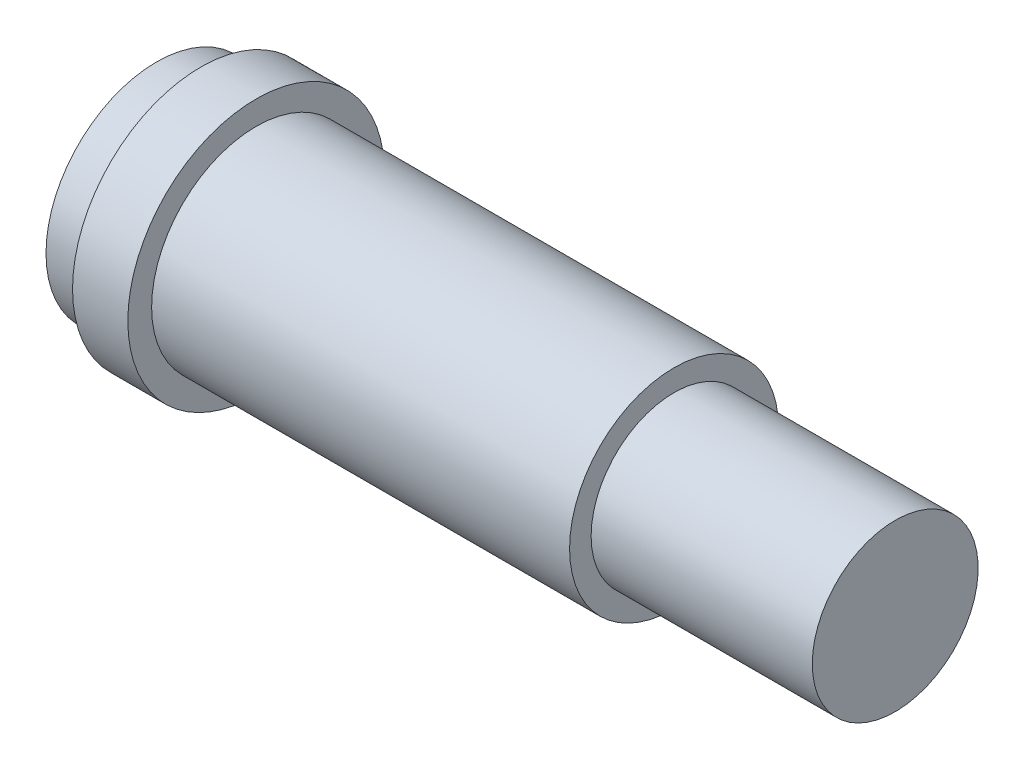
ISO-10303-21;
HEADER;
FILE_DESCRIPTION(('STEP AP214'),'2;1');
FILE_NAME('part.step','',(''),(''),'','','');
FILE_SCHEMA(('AUTOMOTIVE_DESIGN { 1 0 10303 214 1 1 1 1 }'));
ENDSEC;
DATA;
#1=APPLICATION_CONTEXT('core data for automotive mechanical design processes');
#2=APPLICATION_PROTOCOL_DEFINITION('international standard','automotive_design',2000,#1);
#3=PRODUCT_CONTEXT('',#1,'mechanical');
#4=PRODUCT('Part','Part','',(#3));
#5=PRODUCT_RELATED_PRODUCT_CATEGORY('part','',(#4));
#6=PRODUCT_DEFINITION_FORMATION('','',#4);
#7=PRODUCT_DEFINITION_CONTEXT('part definition',#1,'design');
#8=PRODUCT_DEFINITION('design','',#6,#7);
#9=PRODUCT_DEFINITION_SHAPE('','',#8);
#10=(LENGTH_UNIT() NAMED_UNIT(*) SI_UNIT(.MILLI.,.METRE.));
#11=(NAMED_UNIT(*) PLANE_ANGLE_UNIT() SI_UNIT($,.RADIAN.));
#12=(NAMED_UNIT(*) SI_UNIT($,.STERADIAN.) SOLID_ANGLE_UNIT());
#13=UNCERTAINTY_MEASURE_WITH_UNIT(LENGTH_MEASURE(1.E-05),#10,'distance_accuracy_value','');
#14=(GEOMETRIC_REPRESENTATION_CONTEXT(3) GLOBAL_UNCERTAINTY_ASSIGNED_CONTEXT((#13)) GLOBAL_UNIT_ASSIGNED_CONTEXT((#10,
#11,#12)) REPRESENTATION_CONTEXT('',''));
#15=CARTESIAN_POINT('',(0.,0.,0.));
#16=DIRECTION('',(0.,0.,1.));
#17=DIRECTION('',(1.,0.,0.));
#18=AXIS2_PLACEMENT_3D('',#15,#16,#17);
#19=CARTESIAN_POINT('',(18.35,0.,0.));
#20=DIRECTION('',(-1.,0.,0.));
#21=DIRECTION('',(0.,0.,1.));
#22=AXIS2_PLACEMENT_3D('',#19,#20,#21);
#23=PLANE('',#22);
#24=CARTESIAN_POINT('',(18.35,0.,0.));
#25=DIRECTION('',(-1.,0.,0.));
#26=DIRECTION('',(0.,0.,1.));
#27=AXIS2_PLACEMENT_3D('',#24,#25,#26);
#28=CIRCLE('',#27,2.38125);
#29=CARTESIAN_POINT('',(18.35,0.,2.38125));
#30=VERTEX_POINT('',#29);
#31=EDGE_CURVE('E10',#30,#30,#28,.T.);
#32=ORIENTED_EDGE('',*,*,#31,.F.);
#33=EDGE_LOOP('',(#32));
#34=FACE_BOUND('',#33,.T.);
#35=ADVANCED_FACE('F32',(#34),#23,.F.);
#36=CARTESIAN_POINT('',(-160.130718954248,0.,0.));
#37=DIRECTION('',(-1.,0.,0.));
#38=DIRECTION('',(0.,0.,1.));
#39=AXIS2_PLACEMENT_3D('',#36,#37,#38);
#40=CYLINDRICAL_SURFACE('',#39,2.38125);
#41=CARTESIAN_POINT('',(12.,0.,0.));
#42=DIRECTION('',(-1.,0.,0.));
#43=DIRECTION('',(0.,0.,1.));
#44=AXIS2_PLACEMENT_3D('',#41,#42,#43);
#45=CIRCLE('',#44,2.38125);
#46=CARTESIAN_POINT('',(12.,0.,2.38125));
#47=VERTEX_POINT('',#46);
#48=EDGE_CURVE('E39',#47,#47,#45,.T.);
#49=ORIENTED_EDGE('',*,*,#48,.F.);
#50=EDGE_LOOP('',(#49));
#51=FACE_BOUND('',#50,.T.);
#52=ORIENTED_EDGE('',*,*,#31,.T.);
#53=EDGE_LOOP('',(#52));
#54=FACE_BOUND('',#53,.T.);
#55=ADVANCED_FACE('F76',(#51,#54),#40,.T.);
#56=CARTESIAN_POINT('',(12.,2.38125,0.));
#57=DIRECTION('',(-1.,0.,0.));
#58=DIRECTION('',(0.,0.,1.));
#59=AXIS2_PLACEMENT_3D('',#56,#57,#58);
#60=PLANE('',#59);
#61=CARTESIAN_POINT('',(12.,0.,0.));
#62=DIRECTION('',(-1.,0.,0.));
#63=DIRECTION('',(0.,0.,1.));
#64=AXIS2_PLACEMENT_3D('',#61,#62,#63);
#65=CIRCLE('',#64,3.);
#66=CARTESIAN_POINT('',(12.,0.,3.));
#67=VERTEX_POINT('',#66);
#68=EDGE_CURVE('E43',#67,#67,#65,.T.);
#69=ORIENTED_EDGE('',*,*,#68,.F.);
#70=EDGE_LOOP('',(#69));
#71=FACE_BOUND('',#70,.T.);
#72=ORIENTED_EDGE('',*,*,#48,.T.);
#73=EDGE_LOOP('',(#72));
#74=FACE_BOUND('',#73,.T.);
#75=ADVANCED_FACE('F81',(#71,#74),#60,.F.);
#76=CARTESIAN_POINT('',(-160.130718954248,0.,0.));
#77=DIRECTION('',(-1.,0.,0.));
#78=DIRECTION('',(0.,0.,1.));
#79=AXIS2_PLACEMENT_3D('',#76,#77,#78);
#80=CYLINDRICAL_SURFACE('',#79,3.);
#81=CARTESIAN_POINT('',(0.,0.,0.));
#82=DIRECTION('',(-1.,0.,0.));
#83=DIRECTION('',(0.,0.,1.));
#84=AXIS2_PLACEMENT_3D('',#81,#82,#83);
#85=CIRCLE('',#84,3.);
#86=CARTESIAN_POINT('',(0.,0.,3.));
#87=VERTEX_POINT('',#86);
#88=EDGE_CURVE('E48',#87,#87,#85,.T.);
#89=ORIENTED_EDGE('',*,*,#88,.F.);
#90=EDGE_LOOP('',(#89));
#91=FACE_BOUND('',#90,.T.);
#92=ORIENTED_EDGE('',*,*,#68,.T.);
#93=EDGE_LOOP('',(#92));
#94=FACE_BOUND('',#93,.T.);
#95=ADVANCED_FACE('F86',(#91,#94),#80,.T.);
#96=CARTESIAN_POINT('',(0.,3.,0.));
#97=DIRECTION('',(-1.,0.,0.));
#98=DIRECTION('',(0.,0.,1.));
#99=AXIS2_PLACEMENT_3D('',#96,#97,#98);
#100=PLANE('',#99);
#101=CARTESIAN_POINT('',(0.,0.,0.));
#102=DIRECTION('',(-1.,0.,0.));
#103=DIRECTION('',(0.,0.,1.));
#104=AXIS2_PLACEMENT_3D('',#101,#102,#103);
#105=CIRCLE('',#104,3.683);
#106=CARTESIAN_POINT('',(0.,0.,3.683));
#107=VERTEX_POINT('',#106);
#108=EDGE_CURVE('E51',#107,#107,#105,.T.);
#109=ORIENTED_EDGE('',*,*,#108,.F.);
#110=EDGE_LOOP('',(#109));
#111=FACE_BOUND('',#110,.T.);
#112=ORIENTED_EDGE('',*,*,#88,.T.);
#113=EDGE_LOOP('',(#112));
#114=FACE_BOUND('',#113,.T.);
#115=ADVANCED_FACE('F93',(#111,#114),#100,.F.);
#116=CARTESIAN_POINT('',(-160.130718954248,0.,0.));
#117=DIRECTION('',(-1.,0.,0.));
#118=DIRECTION('',(0.,0.,1.));
#119=AXIS2_PLACEMENT_3D('',#116,#117,#118);
#120=CYLINDRICAL_SURFACE('',#119,3.683);
#121=CARTESIAN_POINT('',(-1.58749999999999,0.,0.));
#122=DIRECTION('',(-1.,0.,0.));
#123=DIRECTION('',(0.,0.,1.));
#124=AXIS2_PLACEMENT_3D('',#121,#122,#123);
#125=CIRCLE('',#124,3.683);
#126=CARTESIAN_POINT('',(-1.58749999999999,0.,3.683));
#127=VERTEX_POINT('',#126);
#128=EDGE_CURVE('E54',#127,#127,#125,.T.);
#129=ORIENTED_EDGE('',*,*,#128,.F.);
#130=EDGE_LOOP('',(#129));
#131=FACE_BOUND('',#130,.T.);
#132=ORIENTED_EDGE('',*,*,#108,.T.);
#133=EDGE_LOOP('',(#132));
#134=FACE_BOUND('',#133,.T.);
#135=ADVANCED_FACE('F97',(#131,#134),#120,.T.);
#136=CARTESIAN_POINT('',(-1.5875,3.683,0.));
#137=DIRECTION('',(1.,0.,0.));
#138=DIRECTION('',(0.,0.,-1.));
#139=AXIS2_PLACEMENT_3D('',#136,#137,#138);
#140=PLANE('',#139);
#141=CARTESIAN_POINT('',(-1.58749999999999,0.,0.));
#142=DIRECTION('',(-1.,0.,0.));
#143=DIRECTION('',(0.,0.,1.));
#144=AXIS2_PLACEMENT_3D('',#141,#142,#143);
#145=CIRCLE('',#144,3.175);
#146=CARTESIAN_POINT('',(-1.58749999999999,0.,3.175));
#147=VERTEX_POINT('',#146);
#148=EDGE_CURVE('E57',#147,#147,#145,.T.);
#149=ORIENTED_EDGE('',*,*,#148,.F.);
#150=EDGE_LOOP('',(#149));
#151=FACE_BOUND('',#150,.T.);
#152=ORIENTED_EDGE('',*,*,#128,.T.);
#153=EDGE_LOOP('',(#152));
#154=FACE_BOUND('',#153,.T.);
#155=ADVANCED_FACE('F73',(#151,#154),#140,.F.);
#156=CARTESIAN_POINT('',(-160.130718954248,0.,0.));
#157=DIRECTION('',(-1.,0.,0.));
#158=DIRECTION('',(0.,0.,1.));
#159=AXIS2_PLACEMENT_3D('',#156,#157,#158);
#160=CYLINDRICAL_SURFACE('',#159,3.175);
#161=CARTESIAN_POINT('',(-2.85750000000004,0.,0.));
#162=DIRECTION('',(1.,0.,0.));
#163=DIRECTION('',(0.,1.,0.));
#164=AXIS2_PLACEMENT_3D('',#161,#162,#163);
#165=CIRCLE('',#164,3.175);
#166=CARTESIAN_POINT('',(-2.85750000000004,3.175,0.));
#167=VERTEX_POINT('',#166);
#168=EDGE_CURVE('E35',#167,#167,#165,.T.);
#169=ORIENTED_EDGE('',*,*,#168,.T.);
#170=EDGE_LOOP('',(#169));
#171=FACE_BOUND('',#170,.T.);
#172=ORIENTED_EDGE('',*,*,#148,.T.);
#173=EDGE_LOOP('',(#172));
#174=FACE_BOUND('',#173,.T.);
#175=ADVANCED_FACE('F64',(#171,#174),#160,.T.);
#176=CARTESIAN_POINT('',(-2.85750000000003,0.,0.));
#177=DIRECTION('',(1.,0.,0.));
#178=DIRECTION('',(0.,1.,0.));
#179=AXIS2_PLACEMENT_3D('',#176,#177,#178);
#180=PLANE('',#179);
#181=ORIENTED_EDGE('',*,*,#168,.F.);
#182=EDGE_LOOP('',(#181));
#183=FACE_BOUND('',#182,.T.);
#184=ADVANCED_FACE('F66',(#183),#180,.F.);
#185=CLOSED_SHELL('',(#35,#55,#75,#95,#115,#135,#155,#175,#184));
#186=MANIFOLD_SOLID_BREP('B2',#185);
#187=ADVANCED_BREP_SHAPE_REPRESENTATION('',(#18,#186),#14);
#188=SHAPE_DEFINITION_REPRESENTATION(#9,#187);
ENDSEC;
END-ISO-10303-21;
